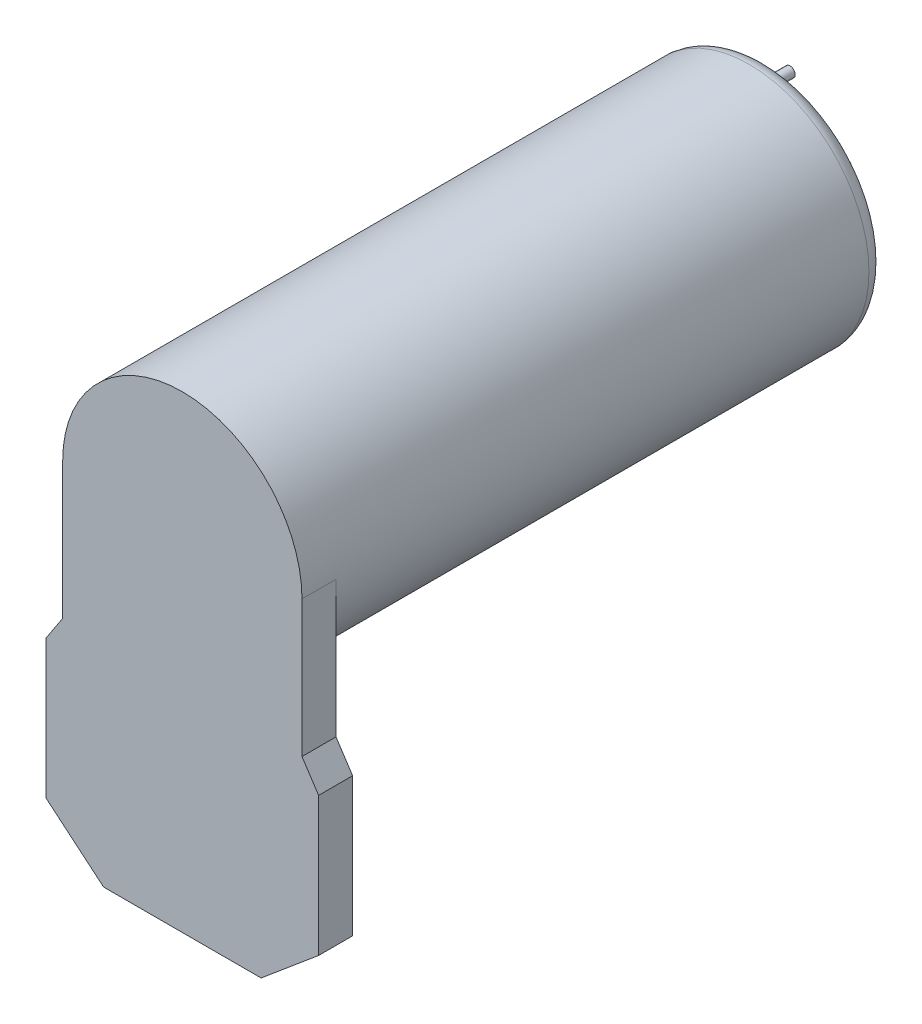
ISO-10303-21;
HEADER;
FILE_DESCRIPTION(('STEP AP214'),'2;1');
FILE_NAME('part.step','',(''),(''),'','','');
FILE_SCHEMA(('AUTOMOTIVE_DESIGN { 1 0 10303 214 1 1 1 1 }'));
ENDSEC;
DATA;
#1=APPLICATION_CONTEXT('core data for automotive mechanical design processes');
#2=APPLICATION_PROTOCOL_DEFINITION('international standard','automotive_design',2000,#1);
#3=PRODUCT_CONTEXT('',#1,'mechanical');
#4=PRODUCT('Part','Part','',(#3));
#5=PRODUCT_RELATED_PRODUCT_CATEGORY('part','',(#4));
#6=PRODUCT_DEFINITION_FORMATION('','',#4);
#7=PRODUCT_DEFINITION_CONTEXT('part definition',#1,'design');
#8=PRODUCT_DEFINITION('design','',#6,#7);
#9=PRODUCT_DEFINITION_SHAPE('','',#8);
#10=(LENGTH_UNIT() NAMED_UNIT(*) SI_UNIT(.MILLI.,.METRE.));
#11=(NAMED_UNIT(*) PLANE_ANGLE_UNIT() SI_UNIT($,.RADIAN.));
#12=(NAMED_UNIT(*) SI_UNIT($,.STERADIAN.) SOLID_ANGLE_UNIT());
#13=UNCERTAINTY_MEASURE_WITH_UNIT(LENGTH_MEASURE(1.E-05),#10,'distance_accuracy_value','');
#14=(GEOMETRIC_REPRESENTATION_CONTEXT(3) GLOBAL_UNCERTAINTY_ASSIGNED_CONTEXT((#13)) GLOBAL_UNIT_ASSIGNED_CONTEXT((#10,
#11,#12)) REPRESENTATION_CONTEXT('',''));
#15=CARTESIAN_POINT('',(0.,0.,0.));
#16=DIRECTION('',(0.,0.,1.));
#17=DIRECTION('',(1.,0.,0.));
#18=AXIS2_PLACEMENT_3D('',#15,#16,#17);
#19=CARTESIAN_POINT('',(-9.84807753012209,31.0635182233308,43.4));
#20=DIRECTION('',(0.,0.,-1.));
#21=DIRECTION('',(-1.,0.,0.));
#22=AXIS2_PLACEMENT_3D('',#19,#20,#21);
#23=PLANE('',#22);
#24=CARTESIAN_POINT('',(-9.84807753012209,31.0635182233308,43.4));
#25=DIRECTION('',(0.,0.,-1.));
#26=DIRECTION('',(-1.,0.,0.));
#27=AXIS2_PLACEMENT_3D('',#24,#25,#26);
#28=CIRCLE('',#27,2.5);
#29=CARTESIAN_POINT('',(-12.3480775301221,31.0635182233308,43.4));
#30=VERTEX_POINT('',#29);
#31=EDGE_CURVE('E295',#30,#30,#28,.T.);
#32=ORIENTED_EDGE('',*,*,#31,.T.);
#33=EDGE_LOOP('',(#32));
#34=FACE_BOUND('',#33,.T.);
#35=CARTESIAN_POINT('',(-9.84807753012209,31.0635182233308,43.4));
#36=DIRECTION('',(0.,0.,-1.));
#37=DIRECTION('',(-1.,0.,0.));
#38=AXIS2_PLACEMENT_3D('',#35,#36,#37);
#39=CIRCLE('',#38,0.75);
#40=CARTESIAN_POINT('',(-10.5980775301221,31.0635182233308,43.4));
#41=VERTEX_POINT('',#40);
#42=EDGE_CURVE('E338',#41,#41,#39,.T.);
#43=ORIENTED_EDGE('',*,*,#42,.F.);
#44=EDGE_LOOP('',(#43));
#45=FACE_BOUND('',#44,.T.);
#46=ADVANCED_FACE('F34',(#34,#45),#23,.T.);
#47=CARTESIAN_POINT('',(-4.99999999999998,41.4602540378444,43.4));
#48=DIRECTION('',(0.,0.,-1.));
#49=DIRECTION('',(-1.,0.,0.));
#50=AXIS2_PLACEMENT_3D('',#47,#48,#49);
#51=PLANE('',#50);
#52=CARTESIAN_POINT('',(-4.99999999999998,41.4602540378444,43.4));
#53=DIRECTION('',(0.,0.,-1.));
#54=DIRECTION('',(-1.,0.,0.));
#55=AXIS2_PLACEMENT_3D('',#52,#53,#54);
#56=CIRCLE('',#55,2.50000000000001);
#57=CARTESIAN_POINT('',(-7.49999999999999,41.4602540378444,43.4));
#58=VERTEX_POINT('',#57);
#59=EDGE_CURVE('E298',#58,#58,#56,.T.);
#60=ORIENTED_EDGE('',*,*,#59,.T.);
#61=EDGE_LOOP('',(#60));
#62=FACE_BOUND('',#61,.T.);
#63=CARTESIAN_POINT('',(-4.99999999999998,41.4602540378444,43.4));
#64=DIRECTION('',(0.,0.,-1.));
#65=DIRECTION('',(-1.,0.,0.));
#66=AXIS2_PLACEMENT_3D('',#63,#64,#65);
#67=CIRCLE('',#66,0.750000000000008);
#68=CARTESIAN_POINT('',(-5.74999999999999,41.4602540378444,43.4));
#69=VERTEX_POINT('',#68);
#70=EDGE_CURVE('E332',#69,#69,#67,.T.);
#71=ORIENTED_EDGE('',*,*,#70,.F.);
#72=EDGE_LOOP('',(#71));
#73=FACE_BOUND('',#72,.T.);
#74=ADVANCED_FACE('F203',(#62,#73),#51,.T.);
#75=CARTESIAN_POINT('',(0.,38.8,44.4));
#76=DIRECTION('',(0.,0.,1.));
#77=DIRECTION('',(1.,0.,0.));
#78=AXIS2_PLACEMENT_3D('',#75,#76,#77);
#79=PLANE('',#78);
#80=CARTESIAN_POINT('',(-9.84807753012209,31.0635182233308,44.4));
#81=DIRECTION('',(0.,0.,1.));
#82=DIRECTION('',(1.,0.,0.));
#83=AXIS2_PLACEMENT_3D('',#80,#81,#82);
#84=CIRCLE('',#83,2.5);
#85=CARTESIAN_POINT('',(-7.34807753012209,31.0635182233308,44.4));
#86=VERTEX_POINT('',#85);
#87=EDGE_CURVE('E42',#86,#86,#84,.F.);
#88=ORIENTED_EDGE('',*,*,#87,.F.);
#89=EDGE_LOOP('',(#88));
#90=FACE_BOUND('',#89,.T.);
#91=CARTESIAN_POINT('',(0.,32.8,44.4));
#92=DIRECTION('',(0.,0.,1.));
#93=DIRECTION('',(1.,0.,0.));
#94=AXIS2_PLACEMENT_3D('',#91,#92,#93);
#95=CIRCLE('',#94,15.1);
#96=CARTESIAN_POINT('',(15.1,32.8,44.4));
#97=VERTEX_POINT('',#96);
#98=EDGE_CURVE('E208',#97,#97,#95,.T.);
#99=ORIENTED_EDGE('',*,*,#98,.F.);
#100=EDGE_LOOP('',(#99));
#101=FACE_BOUND('',#100,.T.);
#102=CARTESIAN_POINT('',(0.,32.8,44.4));
#103=DIRECTION('',(0.,0.,1.));
#104=DIRECTION('',(1.,0.,0.));
#105=AXIS2_PLACEMENT_3D('',#102,#103,#104);
#106=CIRCLE('',#105,6.);
#107=CARTESIAN_POINT('',(6.,32.8,44.4));
#108=VERTEX_POINT('',#107);
#109=EDGE_CURVE('E212',#108,#108,#106,.T.);
#110=ORIENTED_EDGE('',*,*,#109,.T.);
#111=EDGE_LOOP('',(#110));
#112=FACE_BOUND('',#111,.T.);
#113=CARTESIAN_POINT('',(-4.99999999999998,41.4602540378444,44.4));
#114=DIRECTION('',(0.,0.,1.));
#115=DIRECTION('',(1.,0.,0.));
#116=AXIS2_PLACEMENT_3D('',#113,#114,#115);
#117=CIRCLE('',#116,2.50000000000001);
#118=CARTESIAN_POINT('',(-2.49999999999997,41.4602540378444,44.4));
#119=VERTEX_POINT('',#118);
#120=EDGE_CURVE('E11',#119,#119,#117,.F.);
#121=ORIENTED_EDGE('',*,*,#120,.F.);
#122=EDGE_LOOP('',(#121));
#123=FACE_BOUND('',#122,.T.);
#124=ADVANCED_FACE('F199',(#90,#101,#112,#123),#79,.F.);
#125=CARTESIAN_POINT('',(0.,32.8,210.019633717172));
#126=DIRECTION('',(0.,0.,-1.));
#127=DIRECTION('',(-1.,0.,0.));
#128=AXIS2_PLACEMENT_3D('',#125,#126,#127);
#129=CYLINDRICAL_SURFACE('',#128,17.6);
#130=CARTESIAN_POINT('',(0.,32.8,130.3));
#131=DIRECTION('',(0.,0.,1.));
#132=DIRECTION('',(1.,0.,0.));
#133=AXIS2_PLACEMENT_3D('',#130,#131,#132);
#134=CIRCLE('',#133,17.6);
#135=CARTESIAN_POINT('',(17.6,32.8,130.3));
#136=VERTEX_POINT('',#135);
#137=CARTESIAN_POINT('',(-17.6,32.8,130.3));
#138=VERTEX_POINT('',#137);
#139=EDGE_CURVE('E152',#136,#138,#134,.T.);
#140=ORIENTED_EDGE('',*,*,#139,.F.);
#141=DIRECTION('',(0.,0.,-1.));
#142=VECTOR('',#141,1.);
#143=CARTESIAN_POINT('',(17.6,32.8,210.019633717172));
#144=LINE('',#143,#142);
#145=CARTESIAN_POINT('',(17.6,32.8,125.3));
#146=VERTEX_POINT('',#145);
#147=EDGE_CURVE('E49',#136,#146,#144,.T.);
#148=ORIENTED_EDGE('',*,*,#147,.T.);
#149=CARTESIAN_POINT('',(0.,32.8,125.3));
#150=DIRECTION('',(0.,0.,1.));
#151=DIRECTION('',(1.,0.,0.));
#152=AXIS2_PLACEMENT_3D('',#149,#150,#151);
#153=CIRCLE('',#152,17.6);
#154=CARTESIAN_POINT('',(-17.6,32.8,125.3));
#155=VERTEX_POINT('',#154);
#156=EDGE_CURVE('E122',#155,#146,#153,.T.);
#157=ORIENTED_EDGE('',*,*,#156,.F.);
#158=DIRECTION('',(0.,0.,-1.));
#159=VECTOR('',#158,1.);
#160=CARTESIAN_POINT('',(-17.6,32.8,210.019633717172));
#161=LINE('',#160,#159);
#162=EDGE_CURVE('E181',#138,#155,#161,.T.);
#163=ORIENTED_EDGE('',*,*,#162,.F.);
#164=EDGE_LOOP('',(#140,#148,#157,#163));
#165=FACE_BOUND('',#164,.T.);
#166=CARTESIAN_POINT('',(0.,32.8,46.9));
#167=DIRECTION('',(0.,0.,1.));
#168=DIRECTION('',(1.,0.,0.));
#169=AXIS2_PLACEMENT_3D('',#166,#167,#168);
#170=CIRCLE('',#169,17.6);
#171=CARTESIAN_POINT('',(17.6,32.8,46.9));
#172=VERTEX_POINT('',#171);
#173=EDGE_CURVE('E294',#172,#172,#170,.T.);
#174=ORIENTED_EDGE('',*,*,#173,.T.);
#175=EDGE_LOOP('',(#174));
#176=FACE_BOUND('',#175,.T.);
#177=ADVANCED_FACE('F202',(#165,#176),#129,.T.);
#178=CARTESIAN_POINT('',(-17.6,12.7205510344571,210.019633717172));
#179=DIRECTION('',(1.,0.,0.));
#180=DIRECTION('',(0.,0.,-1.));
#181=AXIS2_PLACEMENT_3D('',#178,#179,#180);
#182=PLANE('',#181);
#183=DIRECTION('',(0.,-1.,0.));
#184=VECTOR('',#183,1.);
#185=CARTESIAN_POINT('',(-17.6,12.7205510344571,130.3));
#186=LINE('',#185,#184);
#187=CARTESIAN_POINT('',(-17.6,12.7205510344571,130.3));
#188=VERTEX_POINT('',#187);
#189=EDGE_CURVE('E149',#138,#188,#186,.T.);
#190=ORIENTED_EDGE('',*,*,#189,.F.);
#191=ORIENTED_EDGE('',*,*,#162,.T.);
#192=DIRECTION('',(0.,-1.,0.));
#193=VECTOR('',#192,1.);
#194=CARTESIAN_POINT('',(-17.6,12.7205510344571,125.3));
#195=LINE('',#194,#193);
#196=CARTESIAN_POINT('',(-17.6,12.7205510344571,125.3));
#197=VERTEX_POINT('',#196);
#198=EDGE_CURVE('E160',#155,#197,#195,.T.);
#199=ORIENTED_EDGE('',*,*,#198,.T.);
#200=DIRECTION('',(0.,0.,-1.));
#201=VECTOR('',#200,1.);
#202=CARTESIAN_POINT('',(-17.6,12.7205510344571,210.019633717172));
#203=LINE('',#202,#201);
#204=EDGE_CURVE('E92',#188,#197,#203,.T.);
#205=ORIENTED_EDGE('',*,*,#204,.F.);
#206=EDGE_LOOP('',(#190,#191,#199,#205));
#207=FACE_BOUND('',#206,.T.);
#208=ADVANCED_FACE('F283',(#207),#182,.F.);
#209=CARTESIAN_POINT('',(-20.05,9.,210.019633717172));
#210=DIRECTION('',(0.835183132131829,-0.549971940922869,0.));
#211=DIRECTION('',(0.54997194092287,0.835183132131829,0.));
#212=AXIS2_PLACEMENT_3D('',#209,#210,#211);
#213=PLANE('',#212);
#214=DIRECTION('',(-0.54997194092287,-0.835183132131829,0.));
#215=VECTOR('',#214,1.);
#216=CARTESIAN_POINT('',(-20.05,9.,130.3));
#217=LINE('',#216,#215);
#218=CARTESIAN_POINT('',(-20.05,9.,130.3));
#219=VERTEX_POINT('',#218);
#220=EDGE_CURVE('E100',#188,#219,#217,.T.);
#221=ORIENTED_EDGE('',*,*,#220,.F.);
#222=ORIENTED_EDGE('',*,*,#204,.T.);
#223=DIRECTION('',(-0.54997194092287,-0.835183132131829,0.));
#224=VECTOR('',#223,1.);
#225=CARTESIAN_POINT('',(-20.05,9.,125.3));
#226=LINE('',#225,#224);
#227=CARTESIAN_POINT('',(-20.05,9.,125.3));
#228=VERTEX_POINT('',#227);
#229=EDGE_CURVE('E159',#197,#228,#226,.T.);
#230=ORIENTED_EDGE('',*,*,#229,.T.);
#231=DIRECTION('',(0.,0.,-1.));
#232=VECTOR('',#231,1.);
#233=CARTESIAN_POINT('',(-20.05,9.,210.019633717172));
#234=LINE('',#233,#232);
#235=EDGE_CURVE('E161',#219,#228,#234,.T.);
#236=ORIENTED_EDGE('',*,*,#235,.F.);
#237=EDGE_LOOP('',(#221,#222,#230,#236));
#238=FACE_BOUND('',#237,.T.);
#239=ADVANCED_FACE('F279',(#238),#213,.F.);
#240=CARTESIAN_POINT('',(-20.05,0.,210.019633717172));
#241=DIRECTION('',(1.,0.,0.));
#242=DIRECTION('',(0.,0.,-1.));
#243=AXIS2_PLACEMENT_3D('',#240,#241,#242);
#244=PLANE('',#243);
#245=DIRECTION('',(0.,-1.,0.));
#246=VECTOR('',#245,1.);
#247=CARTESIAN_POINT('',(-20.05,0.,130.3));
#248=LINE('',#247,#246);
#249=CARTESIAN_POINT('',(-20.05,-11.4,130.3));
#250=VERTEX_POINT('',#249);
#251=EDGE_CURVE('E145',#219,#250,#248,.T.);
#252=ORIENTED_EDGE('',*,*,#251,.F.);
#253=ORIENTED_EDGE('',*,*,#235,.T.);
#254=DIRECTION('',(0.,-1.,0.));
#255=VECTOR('',#254,1.);
#256=CARTESIAN_POINT('',(-20.05,0.,125.3));
#257=LINE('',#256,#255);
#258=CARTESIAN_POINT('',(-20.05,-11.4,125.3));
#259=VERTEX_POINT('',#258);
#260=EDGE_CURVE('E163',#228,#259,#257,.T.);
#261=ORIENTED_EDGE('',*,*,#260,.T.);
#262=DIRECTION('',(0.,0.,-1.));
#263=VECTOR('',#262,1.);
#264=CARTESIAN_POINT('',(-20.05,-11.4,210.019633717172));
#265=LINE('',#264,#263);
#266=EDGE_CURVE('E164',#250,#259,#265,.T.);
#267=ORIENTED_EDGE('',*,*,#266,.F.);
#268=EDGE_LOOP('',(#252,#253,#261,#267));
#269=FACE_BOUND('',#268,.T.);
#270=ADVANCED_FACE('F275',(#269),#244,.F.);
#271=CARTESIAN_POINT('',(-20.05,-11.4,210.019633717172));
#272=DIRECTION('',(0.642787609686538,0.766044443118979,0.));
#273=DIRECTION('',(-0.766044443118979,0.642787609686538,0.));
#274=AXIS2_PLACEMENT_3D('',#271,#272,#273);
#275=PLANE('',#274);
#276=DIRECTION('',(0.766044443118979,-0.642787609686538,0.));
#277=VECTOR('',#276,1.);
#278=CARTESIAN_POINT('',(-20.05,-11.4,130.3));
#279=LINE('',#278,#277);
#280=CARTESIAN_POINT('',(-11.5885494925811,-18.5,130.3));
#281=VERTEX_POINT('',#280);
#282=EDGE_CURVE('E142',#250,#281,#279,.T.);
#283=ORIENTED_EDGE('',*,*,#282,.F.);
#284=ORIENTED_EDGE('',*,*,#266,.T.);
#285=DIRECTION('',(0.766044443118979,-0.642787609686538,0.));
#286=VECTOR('',#285,1.);
#287=CARTESIAN_POINT('',(-20.05,-11.4,125.3));
#288=LINE('',#287,#286);
#289=CARTESIAN_POINT('',(-11.5885494925811,-18.5,125.3));
#290=VERTEX_POINT('',#289);
#291=EDGE_CURVE('E166',#259,#290,#288,.T.);
#292=ORIENTED_EDGE('',*,*,#291,.T.);
#293=DIRECTION('',(0.,0.,-1.));
#294=VECTOR('',#293,1.);
#295=CARTESIAN_POINT('',(-11.5885494925811,-18.5,210.019633717172));
#296=LINE('',#295,#294);
#297=EDGE_CURVE('E167',#281,#290,#296,.T.);
#298=ORIENTED_EDGE('',*,*,#297,.F.);
#299=EDGE_LOOP('',(#283,#284,#292,#298));
#300=FACE_BOUND('',#299,.T.);
#301=ADVANCED_FACE('F271',(#300),#275,.F.);
#302=CARTESIAN_POINT('',(11.5885494925811,-18.5,210.019633717172));
#303=DIRECTION('',(0.,1.,0.));
#304=DIRECTION('',(-1.,0.,0.));
#305=AXIS2_PLACEMENT_3D('',#302,#303,#304);
#306=PLANE('',#305);
#307=DIRECTION('',(1.,0.,0.));
#308=VECTOR('',#307,1.);
#309=CARTESIAN_POINT('',(11.5885494925811,-18.5,130.3));
#310=LINE('',#309,#308);
#311=CARTESIAN_POINT('',(11.5885494925811,-18.5,130.3));
#312=VERTEX_POINT('',#311);
#313=EDGE_CURVE('E137',#281,#312,#310,.T.);
#314=ORIENTED_EDGE('',*,*,#313,.F.);
#315=ORIENTED_EDGE('',*,*,#297,.T.);
#316=DIRECTION('',(1.,0.,0.));
#317=VECTOR('',#316,1.);
#318=CARTESIAN_POINT('',(11.5885494925811,-18.5,125.3));
#319=LINE('',#318,#317);
#320=CARTESIAN_POINT('',(11.5885494925811,-18.5,125.3));
#321=VERTEX_POINT('',#320);
#322=EDGE_CURVE('E169',#290,#321,#319,.T.);
#323=ORIENTED_EDGE('',*,*,#322,.T.);
#324=DIRECTION('',(0.,0.,-1.));
#325=VECTOR('',#324,1.);
#326=CARTESIAN_POINT('',(11.5885494925811,-18.5,210.019633717172));
#327=LINE('',#326,#325);
#328=EDGE_CURVE('E170',#312,#321,#327,.T.);
#329=ORIENTED_EDGE('',*,*,#328,.F.);
#330=EDGE_LOOP('',(#314,#315,#323,#329));
#331=FACE_BOUND('',#330,.T.);
#332=ADVANCED_FACE('F267',(#331),#306,.F.);
#333=CARTESIAN_POINT('',(20.05,-11.4,210.019633717172));
#334=DIRECTION('',(-0.642787609686538,0.766044443118979,0.));
#335=DIRECTION('',(-0.766044443118979,-0.642787609686538,0.));
#336=AXIS2_PLACEMENT_3D('',#333,#334,#335);
#337=PLANE('',#336);
#338=DIRECTION('',(0.766044443118979,0.642787609686538,0.));
#339=VECTOR('',#338,1.);
#340=CARTESIAN_POINT('',(20.05,-11.4,130.3));
#341=LINE('',#340,#339);
#342=CARTESIAN_POINT('',(20.05,-11.4,130.3));
#343=VERTEX_POINT('',#342);
#344=EDGE_CURVE('E135',#312,#343,#341,.T.);
#345=ORIENTED_EDGE('',*,*,#344,.F.);
#346=ORIENTED_EDGE('',*,*,#328,.T.);
#347=DIRECTION('',(0.766044443118979,0.642787609686538,0.));
#348=VECTOR('',#347,1.);
#349=CARTESIAN_POINT('',(20.05,-11.4,125.3));
#350=LINE('',#349,#348);
#351=CARTESIAN_POINT('',(20.05,-11.4,125.3));
#352=VERTEX_POINT('',#351);
#353=EDGE_CURVE('E172',#321,#352,#350,.T.);
#354=ORIENTED_EDGE('',*,*,#353,.T.);
#355=DIRECTION('',(0.,0.,-1.));
#356=VECTOR('',#355,1.);
#357=CARTESIAN_POINT('',(20.05,-11.4,210.019633717172));
#358=LINE('',#357,#356);
#359=EDGE_CURVE('E173',#343,#352,#358,.T.);
#360=ORIENTED_EDGE('',*,*,#359,.F.);
#361=EDGE_LOOP('',(#345,#346,#354,#360));
#362=FACE_BOUND('',#361,.T.);
#363=ADVANCED_FACE('F264',(#362),#337,.F.);
#364=CARTESIAN_POINT('',(20.05,0.,210.019633717172));
#365=DIRECTION('',(-1.,0.,0.));
#366=DIRECTION('',(0.,0.,1.));
#367=AXIS2_PLACEMENT_3D('',#364,#365,#366);
#368=PLANE('',#367);
#369=DIRECTION('',(0.,1.,0.));
#370=VECTOR('',#369,1.);
#371=CARTESIAN_POINT('',(20.05,0.,130.3));
#372=LINE('',#371,#370);
#373=CARTESIAN_POINT('',(20.05,9.,130.3));
#374=VERTEX_POINT('',#373);
#375=EDGE_CURVE('E123',#343,#374,#372,.T.);
#376=ORIENTED_EDGE('',*,*,#375,.F.);
#377=ORIENTED_EDGE('',*,*,#359,.T.);
#378=DIRECTION('',(0.,1.,0.));
#379=VECTOR('',#378,1.);
#380=CARTESIAN_POINT('',(20.05,0.,125.3));
#381=LINE('',#380,#379);
#382=CARTESIAN_POINT('',(20.05,9.,125.3));
#383=VERTEX_POINT('',#382);
#384=EDGE_CURVE('E129',#352,#383,#381,.T.);
#385=ORIENTED_EDGE('',*,*,#384,.T.);
#386=DIRECTION('',(0.,0.,-1.));
#387=VECTOR('',#386,1.);
#388=CARTESIAN_POINT('',(20.05,9.,210.019633717172));
#389=LINE('',#388,#387);
#390=EDGE_CURVE('E117',#374,#383,#389,.T.);
#391=ORIENTED_EDGE('',*,*,#390,.F.);
#392=EDGE_LOOP('',(#376,#377,#385,#391));
#393=FACE_BOUND('',#392,.T.);
#394=ADVANCED_FACE('F126',(#393),#368,.F.);
#395=CARTESIAN_POINT('',(20.05,9.,210.019633717172));
#396=DIRECTION('',(-0.835183132131829,-0.549971940922869,0.));
#397=DIRECTION('',(0.54997194092287,-0.835183132131829,0.));
#398=AXIS2_PLACEMENT_3D('',#395,#396,#397);
#399=PLANE('',#398);
#400=DIRECTION('',(-0.54997194092287,0.835183132131829,0.));
#401=VECTOR('',#400,1.);
#402=CARTESIAN_POINT('',(20.05,9.,130.3));
#403=LINE('',#402,#401);
#404=CARTESIAN_POINT('',(17.6,12.7205510344571,130.3));
#405=VERTEX_POINT('',#404);
#406=EDGE_CURVE('E114',#374,#405,#403,.T.);
#407=ORIENTED_EDGE('',*,*,#406,.F.);
#408=ORIENTED_EDGE('',*,*,#390,.T.);
#409=DIRECTION('',(-0.54997194092287,0.835183132131829,0.));
#410=VECTOR('',#409,1.);
#411=CARTESIAN_POINT('',(20.05,9.,125.3));
#412=LINE('',#411,#410);
#413=CARTESIAN_POINT('',(17.6,12.7205510344571,125.3));
#414=VERTEX_POINT('',#413);
#415=EDGE_CURVE('E131',#383,#414,#412,.T.);
#416=ORIENTED_EDGE('',*,*,#415,.T.);
#417=DIRECTION('',(0.,0.,-1.));
#418=VECTOR('',#417,1.);
#419=CARTESIAN_POINT('',(17.6,12.7205510344571,210.019633717172));
#420=LINE('',#419,#418);
#421=EDGE_CURVE('E55',#405,#414,#420,.T.);
#422=ORIENTED_EDGE('',*,*,#421,.F.);
#423=EDGE_LOOP('',(#407,#408,#416,#422));
#424=FACE_BOUND('',#423,.T.);
#425=ADVANCED_FACE('F116',(#424),#399,.F.);
#426=CARTESIAN_POINT('',(17.6,12.7205510344571,210.019633717172));
#427=DIRECTION('',(-1.,0.,0.));
#428=DIRECTION('',(0.,0.,1.));
#429=AXIS2_PLACEMENT_3D('',#426,#427,#428);
#430=PLANE('',#429);
#431=DIRECTION('',(0.,1.,0.));
#432=VECTOR('',#431,1.);
#433=CARTESIAN_POINT('',(17.6,12.7205510344571,130.3));
#434=LINE('',#433,#432);
#435=EDGE_CURVE('E155',#405,#136,#434,.T.);
#436=ORIENTED_EDGE('',*,*,#435,.F.);
#437=ORIENTED_EDGE('',*,*,#421,.T.);
#438=DIRECTION('',(0.,1.,0.));
#439=VECTOR('',#438,1.);
#440=CARTESIAN_POINT('',(17.6,12.7205510344571,125.3));
#441=LINE('',#440,#439);
#442=EDGE_CURVE('E157',#414,#146,#441,.T.);
#443=ORIENTED_EDGE('',*,*,#442,.T.);
#444=ORIENTED_EDGE('',*,*,#147,.F.);
#445=EDGE_LOOP('',(#436,#437,#443,#444));
#446=FACE_BOUND('',#445,.T.);
#447=ADVANCED_FACE('F256',(#446),#430,.F.);
#448=CARTESIAN_POINT('',(0.,32.8,125.3));
#449=DIRECTION('',(0.,0.,1.));
#450=DIRECTION('',(1.,0.,0.));
#451=AXIS2_PLACEMENT_3D('',#448,#449,#450);
#452=PLANE('',#451);
#453=ORIENTED_EDGE('',*,*,#198,.F.);
#454=ORIENTED_EDGE('',*,*,#156,.T.);
#455=ORIENTED_EDGE('',*,*,#442,.F.);
#456=ORIENTED_EDGE('',*,*,#415,.F.);
#457=ORIENTED_EDGE('',*,*,#384,.F.);
#458=ORIENTED_EDGE('',*,*,#353,.F.);
#459=ORIENTED_EDGE('',*,*,#322,.F.);
#460=ORIENTED_EDGE('',*,*,#291,.F.);
#461=ORIENTED_EDGE('',*,*,#260,.F.);
#462=ORIENTED_EDGE('',*,*,#229,.F.);
#463=EDGE_LOOP('',(#453,#454,#455,#456,#457,#458,#459,#460,#461,#462));
#464=FACE_BOUND('',#463,.T.);
#465=ADVANCED_FACE('F253',(#464),#452,.F.);
#466=CARTESIAN_POINT('',(0.,0.,130.3));
#467=DIRECTION('',(0.,0.,1.));
#468=DIRECTION('',(1.,0.,0.));
#469=AXIS2_PLACEMENT_3D('',#466,#467,#468);
#470=PLANE('',#469);
#471=ORIENTED_EDGE('',*,*,#435,.T.);
#472=ORIENTED_EDGE('',*,*,#139,.T.);
#473=ORIENTED_EDGE('',*,*,#189,.T.);
#474=ORIENTED_EDGE('',*,*,#220,.T.);
#475=ORIENTED_EDGE('',*,*,#251,.T.);
#476=ORIENTED_EDGE('',*,*,#282,.T.);
#477=ORIENTED_EDGE('',*,*,#313,.T.);
#478=ORIENTED_EDGE('',*,*,#344,.T.);
#479=ORIENTED_EDGE('',*,*,#375,.T.);
#480=ORIENTED_EDGE('',*,*,#406,.T.);
#481=EDGE_LOOP('',(#471,#472,#473,#474,#475,#476,#477,#478,#479,#480));
#482=FACE_BOUND('',#481,.T.);
#483=ADVANCED_FACE('F36',(#482),#470,.T.);
#484=CARTESIAN_POINT('',(0.,36.4905989232415,40.4));
#485=DIRECTION('',(0.,0.,1.));
#486=DIRECTION('',(1.,0.,0.));
#487=AXIS2_PLACEMENT_3D('',#484,#485,#486);
#488=PLANE('',#487);
#489=CARTESIAN_POINT('',(0.,32.8,40.4));
#490=DIRECTION('',(0.,0.,1.));
#491=DIRECTION('',(1.,0.,0.));
#492=AXIS2_PLACEMENT_3D('',#489,#490,#491);
#493=CIRCLE('',#492,3.69059892324149);
#494=CARTESIAN_POINT('',(3.69059892324149,32.8,40.4));
#495=VERTEX_POINT('',#494);
#496=EDGE_CURVE('E182',#495,#495,#493,.T.);
#497=ORIENTED_EDGE('',*,*,#496,.F.);
#498=EDGE_LOOP('',(#497));
#499=FACE_BOUND('',#498,.T.);
#500=ADVANCED_FACE('F248',(#499),#488,.F.);
#501=CARTESIAN_POINT('',(0.,32.8,40.4));
#502=DIRECTION('',(0.,0.,1.));
#503=DIRECTION('',(1.,0.,0.));
#504=AXIS2_PLACEMENT_3D('',#501,#502,#503);
#505=CONICAL_SURFACE('',#504,3.69059892324149,0.5235987755983);
#506=ORIENTED_EDGE('',*,*,#109,.F.);
#507=EDGE_LOOP('',(#506));
#508=FACE_BOUND('',#507,.T.);
#509=ORIENTED_EDGE('',*,*,#496,.T.);
#510=EDGE_LOOP('',(#509));
#511=FACE_BOUND('',#510,.T.);
#512=ADVANCED_FACE('F243',(#508,#511),#505,.T.);
#513=CARTESIAN_POINT('',(0.,32.8,46.9));
#514=DIRECTION('',(0.,0.,1.));
#515=DIRECTION('',(1.,0.,0.));
#516=AXIS2_PLACEMENT_3D('',#513,#514,#515);
#517=TOROIDAL_SURFACE('',#516,15.1,2.5);
#518=ORIENTED_EDGE('',*,*,#173,.F.);
#519=EDGE_LOOP('',(#518));
#520=FACE_BOUND('',#519,.T.);
#521=ORIENTED_EDGE('',*,*,#98,.T.);
#522=EDGE_LOOP('',(#521));
#523=FACE_BOUND('',#522,.T.);
#524=ADVANCED_FACE('F227',(#520,#523),#517,.T.);
#525=CARTESIAN_POINT('',(-9.84807753012209,31.0635182233308,43.4));
#526=DIRECTION('',(0.,0.,1.));
#527=DIRECTION('',(1.,0.,0.));
#528=AXIS2_PLACEMENT_3D('',#525,#526,#527);
#529=CYLINDRICAL_SURFACE('',#528,2.5);
#530=ORIENTED_EDGE('',*,*,#31,.F.);
#531=EDGE_LOOP('',(#530));
#532=FACE_BOUND('',#531,.T.);
#533=ORIENTED_EDGE('',*,*,#87,.T.);
#534=EDGE_LOOP('',(#533));
#535=FACE_BOUND('',#534,.T.);
#536=ADVANCED_FACE('F197',(#532,#535),#529,.T.);
#537=CARTESIAN_POINT('',(-4.99999999999998,41.4602540378444,43.4));
#538=DIRECTION('',(0.,0.,1.));
#539=DIRECTION('',(1.,0.,0.));
#540=AXIS2_PLACEMENT_3D('',#537,#538,#539);
#541=CYLINDRICAL_SURFACE('',#540,2.50000000000001);
#542=ORIENTED_EDGE('',*,*,#59,.F.);
#543=EDGE_LOOP('',(#542));
#544=FACE_BOUND('',#543,.T.);
#545=ORIENTED_EDGE('',*,*,#120,.T.);
#546=EDGE_LOOP('',(#545));
#547=FACE_BOUND('',#546,.T.);
#548=ADVANCED_FACE('F215',(#544,#547),#541,.T.);
#549=CARTESIAN_POINT('',(-4.99999999999998,41.4602540378444,35.9));
#550=DIRECTION('',(0.,0.,1.));
#551=DIRECTION('',(1.,0.,0.));
#552=AXIS2_PLACEMENT_3D('',#549,#550,#551);
#553=CYLINDRICAL_SURFACE('',#552,0.750000000000008);
#554=CARTESIAN_POINT('',(-4.99999999999998,41.4602540378444,35.9));
#555=DIRECTION('',(0.,0.,-1.));
#556=DIRECTION('',(-1.,0.,0.));
#557=AXIS2_PLACEMENT_3D('',#554,#555,#556);
#558=CIRCLE('',#557,0.750000000000008);
#559=CARTESIAN_POINT('',(-5.74999999999999,41.4602540378444,35.9));
#560=VERTEX_POINT('',#559);
#561=EDGE_CURVE('E331',#560,#560,#558,.T.);
#562=ORIENTED_EDGE('',*,*,#561,.F.);
#563=EDGE_LOOP('',(#562));
#564=FACE_BOUND('',#563,.T.);
#565=ORIENTED_EDGE('',*,*,#70,.T.);
#566=EDGE_LOOP('',(#565));
#567=FACE_BOUND('',#566,.T.);
#568=ADVANCED_FACE('F217',(#564,#567),#553,.T.);
#569=CARTESIAN_POINT('',(-4.99999999999998,41.4602540378444,35.9));
#570=DIRECTION('',(0.,0.,-1.));
#571=DIRECTION('',(-1.,0.,0.));
#572=AXIS2_PLACEMENT_3D('',#569,#570,#571);
#573=PLANE('',#572);
#574=ORIENTED_EDGE('',*,*,#561,.T.);
#575=EDGE_LOOP('',(#574));
#576=FACE_BOUND('',#575,.T.);
#577=ADVANCED_FACE('F224',(#576),#573,.T.);
#578=CARTESIAN_POINT('',(-9.84807753012209,31.0635182233308,35.9));
#579=DIRECTION('',(0.,0.,1.));
#580=DIRECTION('',(1.,0.,0.));
#581=AXIS2_PLACEMENT_3D('',#578,#579,#580);
#582=CYLINDRICAL_SURFACE('',#581,0.75);
#583=CARTESIAN_POINT('',(-9.84807753012209,31.0635182233308,35.9));
#584=DIRECTION('',(0.,0.,-1.));
#585=DIRECTION('',(-1.,0.,0.));
#586=AXIS2_PLACEMENT_3D('',#583,#584,#585);
#587=CIRCLE('',#586,0.75);
#588=CARTESIAN_POINT('',(-10.5980775301221,31.0635182233308,35.9));
#589=VERTEX_POINT('',#588);
#590=EDGE_CURVE('E335',#589,#589,#587,.T.);
#591=ORIENTED_EDGE('',*,*,#590,.F.);
#592=EDGE_LOOP('',(#591));
#593=FACE_BOUND('',#592,.T.);
#594=ORIENTED_EDGE('',*,*,#42,.T.);
#595=EDGE_LOOP('',(#594));
#596=FACE_BOUND('',#595,.T.);
#597=ADVANCED_FACE('F346',(#593,#596),#582,.T.);
#598=CARTESIAN_POINT('',(-9.84807753012209,31.0635182233308,35.9));
#599=DIRECTION('',(0.,0.,-1.));
#600=DIRECTION('',(-1.,0.,0.));
#601=AXIS2_PLACEMENT_3D('',#598,#599,#600);
#602=PLANE('',#601);
#603=ORIENTED_EDGE('',*,*,#590,.T.);
#604=EDGE_LOOP('',(#603));
#605=FACE_BOUND('',#604,.T.);
#606=ADVANCED_FACE('F344',(#605),#602,.T.);
#607=CLOSED_SHELL('',(#46,#74,#124,#177,#208,#239,#270,#301,#332,#363,#394,#425,#447,#465,#483,
#500,#512,#524,#536,#548,#568,#577,#597,#606));
#608=MANIFOLD_SOLID_BREP('B2',#607);
#609=ADVANCED_BREP_SHAPE_REPRESENTATION('',(#18,#608),#14);
#610=SHAPE_DEFINITION_REPRESENTATION(#9,#609);
ENDSEC;
END-ISO-10303-21;
